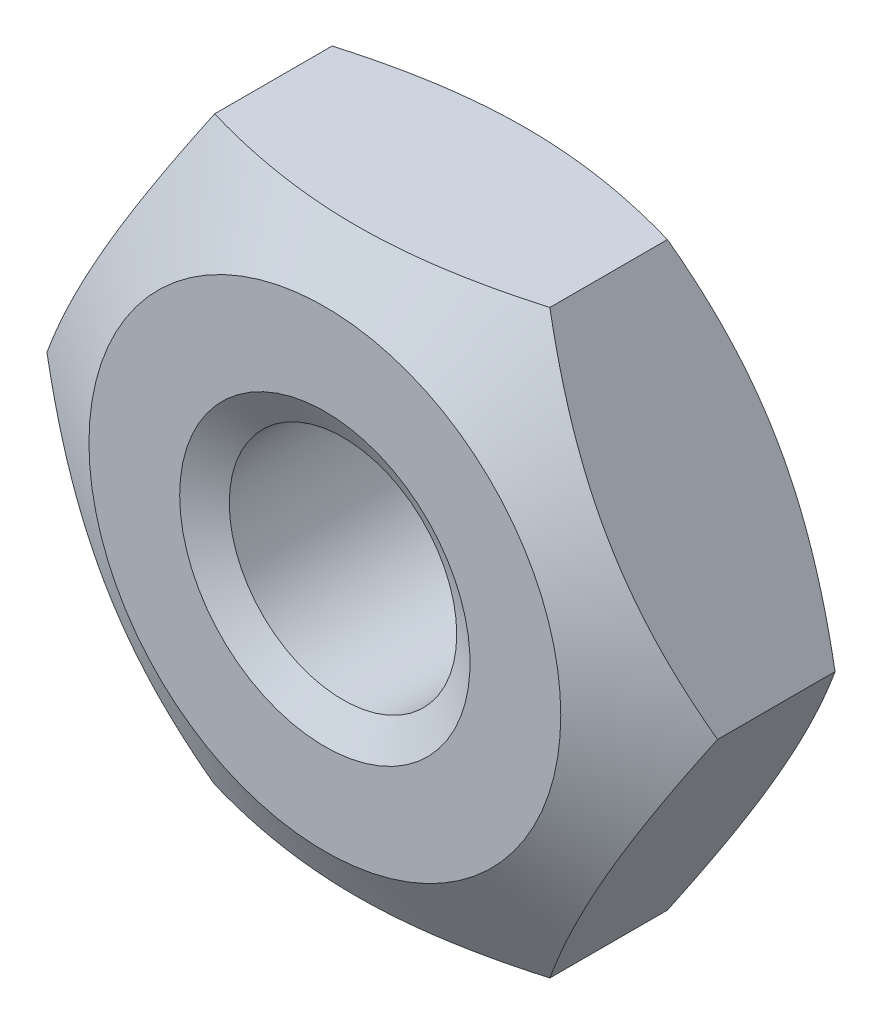
ISO-10303-21;
HEADER;
FILE_DESCRIPTION(('STEP AP214'),'2;1');
FILE_NAME('part.step','',(''),(''),'','','');
FILE_SCHEMA(('AUTOMOTIVE_DESIGN { 1 0 10303 214 1 1 1 1 }'));
ENDSEC;
DATA;
#1=APPLICATION_CONTEXT('core data for automotive mechanical design processes');
#2=APPLICATION_PROTOCOL_DEFINITION('international standard','automotive_design',2000,#1);
#3=PRODUCT_CONTEXT('',#1,'mechanical');
#4=PRODUCT('Part','Part','',(#3));
#5=PRODUCT_RELATED_PRODUCT_CATEGORY('part','',(#4));
#6=PRODUCT_DEFINITION_FORMATION('','',#4);
#7=PRODUCT_DEFINITION_CONTEXT('part definition',#1,'design');
#8=PRODUCT_DEFINITION('design','',#6,#7);
#9=PRODUCT_DEFINITION_SHAPE('','',#8);
#10=(LENGTH_UNIT() NAMED_UNIT(*) SI_UNIT(.MILLI.,.METRE.));
#11=(NAMED_UNIT(*) PLANE_ANGLE_UNIT() SI_UNIT($,.RADIAN.));
#12=(NAMED_UNIT(*) SI_UNIT($,.STERADIAN.) SOLID_ANGLE_UNIT());
#13=UNCERTAINTY_MEASURE_WITH_UNIT(LENGTH_MEASURE(1.E-05),#10,'distance_accuracy_value','');
#14=(GEOMETRIC_REPRESENTATION_CONTEXT(3) GLOBAL_UNCERTAINTY_ASSIGNED_CONTEXT((#13)) GLOBAL_UNIT_ASSIGNED_CONTEXT((#10,
#11,#12)) REPRESENTATION_CONTEXT('',''));
#15=CARTESIAN_POINT('',(0.,0.,0.));
#16=DIRECTION('',(0.,0.,1.));
#17=DIRECTION('',(1.,0.,0.));
#18=AXIS2_PLACEMENT_3D('',#15,#16,#17);
#19=CARTESIAN_POINT('',(1.15470053837925,-2.,-1.6));
#20=DIRECTION('',(0.866025403784439,-0.5,0.));
#21=DIRECTION('',(0.5,0.866025403784439,0.));
#22=AXIS2_PLACEMENT_3D('',#19,#20,#21);
#23=PLANE('',#22);
#24=CARTESIAN_POINT('',(1.15458506832542,-2.0002,-0.395205817566604));
#25=CARTESIAN_POINT('',(1.20532911262018,-1.91230873709994,-0.365895887046785));
#26=CARTESIAN_POINT('',(1.2565111744778,-1.82365880552641,-0.339239202926574));
#27=CARTESIAN_POINT('',(1.3597616401932,-1.6448237530022,-0.292708841966829));
#28=CARTESIAN_POINT('',(1.41183187919145,-1.55463545349496,-0.272851627328887));
#29=CARTESIAN_POINT('',(1.51532701829183,-1.37537661423669,-0.241939814969361));
#30=CARTESIAN_POINT('',(1.56673599086579,-1.2863336617737,-0.230679502544639));
#31=CARTESIAN_POINT('',(1.66979593505373,-1.10782860221496,-0.21723501354075));
#32=CARTESIAN_POINT('',(1.72144653186532,-1.01836714429604,-0.215039705899577));
#33=CARTESIAN_POINT('',(1.81796535054794,-0.851191646451202,-0.219597340276757));
#34=CARTESIAN_POINT('',(1.86284799277603,-0.773452629734217,-0.225231225633123));
#35=CARTESIAN_POINT('',(1.95232085557725,-0.618481085463868,-0.243090246206937));
#36=CARTESIAN_POINT('',(1.99691076648954,-0.541249094258803,-0.255321486969548));
#37=CARTESIAN_POINT('',(2.08656822922816,-0.3859578135178,-0.285899787813718));
#38=CARTESIAN_POINT('',(2.13162442866767,-0.307918186892622,-0.304376518011823));
#39=CARTESIAN_POINT('',(2.221064675979,-0.153003134307867,-0.346311869158963));
#40=CARTESIAN_POINT('',(2.26544987045196,-0.0761257223768818,-0.36976063143842));
#41=CARTESIAN_POINT('',(2.30951654681234,0.000199999999998162,-0.395205817566604));
#42=B_SPLINE_CURVE_WITH_KNOTS('',3,(#24,#25,#26,#27,#28,#29,#30,#31,#32,#33,#34,#35,#36,#37,#38,
#39,#40,#41),.UNSPECIFIED.,.F.,.F.,(4,2,2,2,2,2,2,2,4),(0.,0.317031824695609,0.634825876346563,
0.944753967652635,1.25430138000371,1.52387047293094,1.79368946861028,2.06949491027634,
2.34475850821472),.UNSPECIFIED.);
#43=CARTESIAN_POINT('',(1.15470053837925,-2.,-0.395139145900186));
#44=VERTEX_POINT('',#43);
#45=CARTESIAN_POINT('',(2.3094010767585,0.,-0.395139145900186));
#46=VERTEX_POINT('',#45);
#47=EDGE_CURVE('E49',#44,#46,#42,.T.);
#48=ORIENTED_EDGE('',*,*,#47,.F.);
#49=DIRECTION('',(0.,0.,1.));
#50=VECTOR('',#49,1.);
#51=CARTESIAN_POINT('',(1.15470053837925,-2.,-1.6));
#52=LINE('',#51,#50);
#53=CARTESIAN_POINT('',(1.15470053837925,-2.,-1.20486085409981));
#54=VERTEX_POINT('',#53);
#55=EDGE_CURVE('E113',#54,#44,#52,.T.);
#56=ORIENTED_EDGE('',*,*,#55,.F.);
#57=CARTESIAN_POINT('',(2.30951654681234,0.000199999999998123,-1.2047941824334));
#58=CARTESIAN_POINT('',(2.25877250251758,-0.0876912629000618,-1.23410411295321));
#59=CARTESIAN_POINT('',(2.20759044065996,-0.176341194473593,-1.26076079707343));
#60=CARTESIAN_POINT('',(2.10433997494456,-0.355176246997804,-1.30729115803317));
#61=CARTESIAN_POINT('',(2.05226973594631,-0.445364546505038,-1.32714837267111));
#62=CARTESIAN_POINT('',(1.94877459684592,-0.624623385763308,-1.35806018503064));
#63=CARTESIAN_POINT('',(1.89736562427197,-0.713666338226306,-1.36932049745536));
#64=CARTESIAN_POINT('',(1.79430568008403,-0.892171397785045,-1.38276498645925));
#65=CARTESIAN_POINT('',(1.74265508327244,-0.98163285570396,-1.38496029410042));
#66=CARTESIAN_POINT('',(1.64613626458982,-1.1488083535488,-1.38040265972324));
#67=CARTESIAN_POINT('',(1.60125362236173,-1.22654737026578,-1.37476877436688));
#68=CARTESIAN_POINT('',(1.51178075956051,-1.38151891453613,-1.35690975379306));
#69=CARTESIAN_POINT('',(1.46719084864821,-1.4587509057412,-1.34467851303045));
#70=CARTESIAN_POINT('',(1.37753338590959,-1.6140421864822,-1.31410021218628));
#71=CARTESIAN_POINT('',(1.33247718647009,-1.69208181310738,-1.29562348198818));
#72=CARTESIAN_POINT('',(1.24303693915876,-1.84699686569213,-1.25368813084104));
#73=CARTESIAN_POINT('',(1.1986517446858,-1.92387427762312,-1.23023936856158));
#74=CARTESIAN_POINT('',(1.15458506832542,-2.0002,-1.2047941824334));
#75=B_SPLINE_CURVE_WITH_KNOTS('',3,(#57,#58,#59,#60,#61,#62,#63,#64,#65,#66,#67,#68,#69,#70,#71,
#72,#73,#74),.UNSPECIFIED.,.F.,.F.,(4,2,2,2,2,2,2,2,4),(0.,0.317031824695609,0.634825876346563,
0.944753967652635,1.25430138000371,1.52387047293094,1.79368946861028,2.06949491027633,
2.34475850821472),.UNSPECIFIED.);
#76=CARTESIAN_POINT('',(2.3094010767585,0.,-1.20486085409981));
#77=VERTEX_POINT('',#76);
#78=EDGE_CURVE('E124',#77,#54,#75,.T.);
#79=ORIENTED_EDGE('',*,*,#78,.F.);
#80=DIRECTION('',(0.,0.,1.));
#81=VECTOR('',#80,1.);
#82=CARTESIAN_POINT('',(2.3094010767585,0.,-1.6));
#83=LINE('',#82,#81);
#84=EDGE_CURVE('E121',#77,#46,#83,.T.);
#85=ORIENTED_EDGE('',*,*,#84,.T.);
#86=EDGE_LOOP('',(#48,#56,#79,#85));
#87=FACE_BOUND('',#86,.T.);
#88=ADVANCED_FACE('F34',(#87),#23,.T.);
#89=CARTESIAN_POINT('',(-1.15470053837925,-2.,-1.6));
#90=DIRECTION('',(0.,-1.,0.));
#91=DIRECTION('',(0.,0.,-1.));
#92=AXIS2_PLACEMENT_3D('',#89,#90,#91);
#93=PLANE('',#92);
#94=CARTESIAN_POINT('',(-3.03250840446918,-2.,-1.15911418467749));
#95=CARTESIAN_POINT('',(-2.94570216761566,-2.,-1.11728838375975));
#96=CARTESIAN_POINT('',(-2.85868903658518,-2.,-1.07588421357432));
#97=CARTESIAN_POINT('',(-2.68413865700594,-2.,-0.994157816570392));
#98=CARTESIAN_POINT('',(-2.59660132161435,-2.,-0.953835775449659));
#99=CARTESIAN_POINT('',(-2.42040708466766,-2.,-0.874294412119375));
#100=CARTESIAN_POINT('',(-2.33174662853969,-2.,-0.835082935009986));
#101=CARTESIAN_POINT('',(-2.15369573865635,-2.,-0.758360253248594));
#102=CARTESIAN_POINT('',(-2.06430534187055,-2.,-0.720848963109221));
#103=CARTESIAN_POINT('',(-1.8820653553478,-2.,-0.646928613773647));
#104=CARTESIAN_POINT('',(-1.78919019398347,-2.,-0.610582236381783));
#105=CARTESIAN_POINT('',(-1.60232809770304,-2.,-0.540811653175612));
#106=CARTESIAN_POINT('',(-1.50834103590926,-2.,-0.507387784568963));
#107=CARTESIAN_POINT('',(-1.31930912607903,-2.,-0.444391999492289));
#108=CARTESIAN_POINT('',(-1.22426717272704,-2.,-0.41481148838992));
#109=CARTESIAN_POINT('',(-1.03281454203492,-2.,-0.360492543755219));
#110=CARTESIAN_POINT('',(-0.936404206520195,-2.,-0.335752923018285));
#111=CARTESIAN_POINT('',(-0.742683895879965,-2.,-0.292476872381369));
#112=CARTESIAN_POINT('',(-0.645380883042344,-2.,-0.273909873270285));
#113=CARTESIAN_POINT('',(-0.449641904459803,-2.,-0.244075358121521));
#114=CARTESIAN_POINT('',(-0.35120602504513,-2.,-0.232807289567762));
#115=CARTESIAN_POINT('',(-0.154944401250975,-2.,-0.218620651886438));
#116=CARTESIAN_POINT('',(-0.0571262337389415,-2.,-0.215600250518867));
#117=CARTESIAN_POINT('',(0.13840821715158,-2.,-0.217889203962766));
#118=CARTESIAN_POINT('',(0.23612449621104,-2.,-0.223198898582084));
#119=CARTESIAN_POINT('',(0.474834598693539,-2.,-0.24587699687209));
#120=CARTESIAN_POINT('',(0.615414939156776,-2.,-0.267612933114207));
#121=CARTESIAN_POINT('',(0.89388367740665,-2.,-0.324330248405078));
#122=CARTESIAN_POINT('',(1.03176910046046,-2.,-0.359325481167571));
#123=CARTESIAN_POINT('',(1.30766088186311,-2.,-0.439663106453157));
#124=CARTESIAN_POINT('',(1.44560515870347,-2.,-0.485213217220671));
#125=CARTESIAN_POINT('',(1.71895054267006,-2.,-0.583134546221804));
#126=CARTESIAN_POINT('',(1.85435246826094,-2.,-0.635503524618285));
#127=CARTESIAN_POINT('',(2.16299895593881,-2.,-0.761144092148935));
#128=CARTESIAN_POINT('',(2.33558576685763,-2.,-0.836015496754361));
#129=CARTESIAN_POINT('',(2.67849921319012,-2.,-0.990795114978597));
#130=CARTESIAN_POINT('',(2.84882534036042,-2.,-1.07070443875056));
#131=CARTESIAN_POINT('',(3.18800420393673,-2.,-1.23394816410341));
#132=CARTESIAN_POINT('',(3.35685551895014,-2.,-1.31728550472846));
#133=CARTESIAN_POINT('',(3.69339259485044,-2.,-1.48628333053348));
#134=CARTESIAN_POINT('',(3.86107832131448,-2.,-1.57194388396081));
#135=CARTESIAN_POINT('',(4.18245053956064,-2.,-1.7381347485726));
#136=CARTESIAN_POINT('',(4.33620209616309,-2.,-1.81853954842691));
#137=CARTESIAN_POINT('',(4.64314586019053,-2.,-1.98041904763657));
#138=CARTESIAN_POINT('',(4.7963380513568,-2.,-2.06189377777947));
#139=CARTESIAN_POINT('',(5.10195525058454,-2.,-2.22548861742329));
#140=CARTESIAN_POINT('',(5.25438119884233,-2.,-2.30760697283834));
#141=CARTESIAN_POINT('',(5.55887293685447,-2.,-2.47249183890614));
#142=CARTESIAN_POINT('',(5.71093874332869,-2.,-2.55525831866922));
#143=CARTESIAN_POINT('',(5.86287059695486,-2.,-2.63826829368966));
#144=B_SPLINE_CURVE_WITH_KNOTS('',3,(#94,#95,#96,#97,#98,#99,#100,#101,#102,#103,#104,#105,#106,
#107,#108,#109,#110,#111,#112,#113,#114,#115,#116,#117,#118,#119,#120,#121,#122,#123,#124,#125,
#126,#127,#128,#129,#130,#131,#132,#133,#134,#135,#136,#137,#138,#139,#140,#141,#142,#143),
.UNSPECIFIED.,.F.,.F.,(4,2,2,2,2,2,2,2,2,2,2,2,2,2,2,2,2,2,2,2,2,2,2,2,4),(0.,0.289075652567154,
0.578200598544058,0.869019545903255,1.15982385429035,1.45898764785607,1.7581859143945,
2.0567031465791,2.35514707686766,2.65209018023668,2.94901080291253,3.2422484683487,
3.53549809607817,3.96136880001581,4.38768569908869,4.82323744157937,5.25864647482538,
5.82289331524574,6.38726493035206,6.95213093439244,7.51701355011007,8.03752752207474,
8.55805650494496,9.07747163309884,9.59686215474679),.UNSPECIFIED.);
#145=CARTESIAN_POINT('',(-1.15470053837925,-2.,-0.395139145900186));
#146=VERTEX_POINT('',#145);
#147=EDGE_CURVE('E106',#146,#44,#144,.T.);
#148=ORIENTED_EDGE('',*,*,#147,.F.);
#149=DIRECTION('',(0.,0.,1.));
#150=VECTOR('',#149,1.);
#151=CARTESIAN_POINT('',(-1.15470053837925,-2.,-1.6));
#152=LINE('',#151,#150);
#153=CARTESIAN_POINT('',(-1.15470053837925,-2.,-1.20486085409981));
#154=VERTEX_POINT('',#153);
#155=EDGE_CURVE('E105',#154,#146,#152,.T.);
#156=ORIENTED_EDGE('',*,*,#155,.F.);
#157=CARTESIAN_POINT('',(-3.03250840446918,-2.,-0.440885815322511));
#158=CARTESIAN_POINT('',(-2.94570216761566,-2.,-0.482711616240248));
#159=CARTESIAN_POINT('',(-2.85868903658518,-2.,-0.52411578642568));
#160=CARTESIAN_POINT('',(-2.68413865700594,-2.,-0.605842183429609));
#161=CARTESIAN_POINT('',(-2.59660132161435,-2.,-0.646164224550342));
#162=CARTESIAN_POINT('',(-2.42040708466766,-2.,-0.725705587880626));
#163=CARTESIAN_POINT('',(-2.33174662853969,-2.,-0.764917064990015));
#164=CARTESIAN_POINT('',(-2.15369573865635,-2.,-0.841639746751407));
#165=CARTESIAN_POINT('',(-2.06430534187055,-2.,-0.87915103689078));
#166=CARTESIAN_POINT('',(-1.8820653553478,-2.,-0.953071386226354));
#167=CARTESIAN_POINT('',(-1.78919019398347,-2.,-0.989417763618218));
#168=CARTESIAN_POINT('',(-1.60232809770304,-2.,-1.05918834682439));
#169=CARTESIAN_POINT('',(-1.50834103590926,-2.,-1.09261221543104));
#170=CARTESIAN_POINT('',(-1.31930912607903,-2.,-1.15560800050771));
#171=CARTESIAN_POINT('',(-1.22426717272704,-2.,-1.18518851161008));
#172=CARTESIAN_POINT('',(-1.03281454203492,-2.,-1.23950745624478));
#173=CARTESIAN_POINT('',(-0.936404206520195,-2.,-1.26424707698172));
#174=CARTESIAN_POINT('',(-0.742683895879966,-2.,-1.30752312761863));
#175=CARTESIAN_POINT('',(-0.645380883042344,-2.,-1.32609012672972));
#176=CARTESIAN_POINT('',(-0.449641904459803,-2.,-1.35592464187848));
#177=CARTESIAN_POINT('',(-0.35120602504513,-2.,-1.36719271043224));
#178=CARTESIAN_POINT('',(-0.154944401250975,-2.,-1.38137934811356));
#179=CARTESIAN_POINT('',(-0.0571262337389412,-2.,-1.38439974948113));
#180=CARTESIAN_POINT('',(0.138408217151581,-2.,-1.38211079603723));
#181=CARTESIAN_POINT('',(0.23612449621104,-2.,-1.37680110141792));
#182=CARTESIAN_POINT('',(0.474834598693539,-2.,-1.35412300312791));
#183=CARTESIAN_POINT('',(0.615414939156776,-2.,-1.33238706688579));
#184=CARTESIAN_POINT('',(0.89388367740665,-2.,-1.27566975159492));
#185=CARTESIAN_POINT('',(1.03176910046046,-2.,-1.24067451883243));
#186=CARTESIAN_POINT('',(1.30766088186311,-2.,-1.16033689354684));
#187=CARTESIAN_POINT('',(1.44560515870347,-2.,-1.11478678277933));
#188=CARTESIAN_POINT('',(1.71895054267007,-2.,-1.0168654537782));
#189=CARTESIAN_POINT('',(1.85435246826095,-2.,-0.964496475381715));
#190=CARTESIAN_POINT('',(2.16299895593881,-2.,-0.838855907851066));
#191=CARTESIAN_POINT('',(2.33558576685764,-2.,-0.76398450324564));
#192=CARTESIAN_POINT('',(2.67849921319012,-2.,-0.609204885021404));
#193=CARTESIAN_POINT('',(2.84882534036042,-2.,-0.529295561249443));
#194=CARTESIAN_POINT('',(3.18800420393673,-2.,-0.366051835896594));
#195=CARTESIAN_POINT('',(3.35685551895014,-2.,-0.282714495271539));
#196=CARTESIAN_POINT('',(3.69339259485044,-2.,-0.113716669466521));
#197=CARTESIAN_POINT('',(3.86107832131448,-2.,-0.0280561160391938));
#198=CARTESIAN_POINT('',(4.18245053956064,-2.,0.138134748572596));
#199=CARTESIAN_POINT('',(4.33620209616309,-2.,0.218539548426913));
#200=CARTESIAN_POINT('',(4.64314586019053,-2.,0.380419047636573));
#201=CARTESIAN_POINT('',(4.7963380513568,-2.,0.461893777779472));
#202=CARTESIAN_POINT('',(5.10195525058454,-2.,0.625488617423287));
#203=CARTESIAN_POINT('',(5.25438119884234,-2.,0.707606972838339));
#204=CARTESIAN_POINT('',(5.55887293685447,-2.,0.872491838906139));
#205=CARTESIAN_POINT('',(5.71093874332869,-2.,0.955258318669218));
#206=CARTESIAN_POINT('',(5.86287059695486,-2.,1.03826829368966));
#207=B_SPLINE_CURVE_WITH_KNOTS('',3,(#157,#158,#159,#160,#161,#162,#163,#164,#165,#166,#167,
#168,#169,#170,#171,#172,#173,#174,#175,#176,#177,#178,#179,#180,#181,#182,#183,#184,#185,#186,
#187,#188,#189,#190,#191,#192,#193,#194,#195,#196,#197,#198,#199,#200,#201,#202,#203,#204,#205,
#206),.UNSPECIFIED.,.F.,.F.,(4,2,2,2,2,2,2,2,2,2,2,2,2,2,2,2,2,2,2,2,2,2,2,2,4),(0.,
0.289075652567155,0.578200598544059,0.869019545903256,1.15982385429036,1.45898764785607,
1.75818591439451,2.0567031465791,2.35514707686765,2.65209018023668,2.94901080291253,
3.2422484683487,3.53549809607817,3.96136880001581,4.38768569908869,4.82323744157938,
5.25864647482539,5.82289331524574,6.38726493035206,6.95213093439244,7.51701355011007,
8.03752752207474,8.55805650494497,9.07747163309885,9.59686215474679),.UNSPECIFIED.);
#208=EDGE_CURVE('E200',#54,#154,#207,.F.);
#209=ORIENTED_EDGE('',*,*,#208,.F.);
#210=ORIENTED_EDGE('',*,*,#55,.T.);
#211=EDGE_LOOP('',(#148,#156,#209,#210));
#212=FACE_BOUND('',#211,.T.);
#213=ADVANCED_FACE('F210',(#212),#93,.T.);
#214=CARTESIAN_POINT('',(-2.3094010767585,0.,-1.6));
#215=DIRECTION('',(-0.866025403784438,-0.5,0.));
#216=DIRECTION('',(0.5,-0.866025403784438,0.));
#217=AXIS2_PLACEMENT_3D('',#214,#215,#216);
#218=PLANE('',#217);
#219=CARTESIAN_POINT('',(-2.30951654681234,0.000200000000000497,-0.395205817566603));
#220=CARTESIAN_POINT('',(-2.25877250251757,-0.0876912629000592,-0.365895887046784));
#221=CARTESIAN_POINT('',(-2.20759044065995,-0.176341194473591,-0.339239202926572));
#222=CARTESIAN_POINT('',(-2.10433997494456,-0.355176246997801,-0.292708841966827));
#223=CARTESIAN_POINT('',(-2.0522697359463,-0.445364546505035,-0.272851627328885));
#224=CARTESIAN_POINT('',(-1.94877459684592,-0.624623385763304,-0.241939814969359));
#225=CARTESIAN_POINT('',(-1.89736562427197,-0.713666338226302,-0.230679502544638));
#226=CARTESIAN_POINT('',(-1.79430568008402,-0.892171397785041,-0.217235013540748));
#227=CARTESIAN_POINT('',(-1.74265508327244,-0.981632855703956,-0.215039705899575));
#228=CARTESIAN_POINT('',(-1.64613626458981,-1.1488083535488,-0.219597340276755));
#229=CARTESIAN_POINT('',(-1.60125362236172,-1.22654737026578,-0.225231225633121));
#230=CARTESIAN_POINT('',(-1.51178075956051,-1.38151891453613,-0.243090246206934));
#231=CARTESIAN_POINT('',(-1.46719084864821,-1.4587509057412,-0.255321486969545));
#232=CARTESIAN_POINT('',(-1.37753338590959,-1.6140421864822,-0.285899787813715));
#233=CARTESIAN_POINT('',(-1.33247718647009,-1.69208181310738,-0.304376518011821));
#234=CARTESIAN_POINT('',(-1.24303693915875,-1.84699686569213,-0.346311869158961));
#235=CARTESIAN_POINT('',(-1.1986517446858,-1.92387427762312,-0.369760631438418));
#236=CARTESIAN_POINT('',(-1.15458506832541,-2.0002,-0.395205817566602));
#237=B_SPLINE_CURVE_WITH_KNOTS('',3,(#219,#220,#221,#222,#223,#224,#225,#226,#227,#228,#229,
#230,#231,#232,#233,#234,#235,#236),.UNSPECIFIED.,.F.,.F.,(4,2,2,2,2,2,2,2,4),(0.,
0.317031824695609,0.634825876346562,0.944753967652634,1.25430138000371,1.52387047293094,
1.79368946861028,2.06949491027634,2.34475850821472),.UNSPECIFIED.);
#238=CARTESIAN_POINT('',(-2.3094010767585,0.,-0.395139145900186));
#239=VERTEX_POINT('',#238);
#240=EDGE_CURVE('E89',#239,#146,#237,.T.);
#241=ORIENTED_EDGE('',*,*,#240,.F.);
#242=DIRECTION('',(0.,0.,1.));
#243=VECTOR('',#242,1.);
#244=CARTESIAN_POINT('',(-2.3094010767585,0.,-1.6));
#245=LINE('',#244,#243);
#246=CARTESIAN_POINT('',(-2.3094010767585,0.,-1.20486085409981));
#247=VERTEX_POINT('',#246);
#248=EDGE_CURVE('E103',#247,#239,#245,.T.);
#249=ORIENTED_EDGE('',*,*,#248,.F.);
#250=CARTESIAN_POINT('',(-1.15458506832541,-2.0002,-1.2047941824334));
#251=CARTESIAN_POINT('',(-1.20532911262018,-1.91230873709994,-1.23410411295322));
#252=CARTESIAN_POINT('',(-1.2565111744778,-1.82365880552641,-1.26076079707343));
#253=CARTESIAN_POINT('',(-1.35976164019319,-1.6448237530022,-1.30729115803317));
#254=CARTESIAN_POINT('',(-1.41183187919145,-1.55463545349496,-1.32714837267112));
#255=CARTESIAN_POINT('',(-1.51532701829183,-1.37537661423669,-1.35806018503064));
#256=CARTESIAN_POINT('',(-1.56673599086578,-1.2863336617737,-1.36932049745536));
#257=CARTESIAN_POINT('',(-1.66979593505373,-1.10782860221496,-1.38276498645925));
#258=CARTESIAN_POINT('',(-1.72144653186531,-1.01836714429604,-1.38496029410043));
#259=CARTESIAN_POINT('',(-1.81796535054794,-0.851191646451204,-1.38040265972325));
#260=CARTESIAN_POINT('',(-1.86284799277603,-0.773452629734218,-1.37476877436688));
#261=CARTESIAN_POINT('',(-1.95232085557725,-0.618481085463868,-1.35690975379307));
#262=CARTESIAN_POINT('',(-1.99691076648954,-0.541249094258802,-1.34467851303046));
#263=CARTESIAN_POINT('',(-2.08656822922816,-0.3859578135178,-1.31410021218629));
#264=CARTESIAN_POINT('',(-2.13162442866767,-0.307918186892621,-1.29562348198818));
#265=CARTESIAN_POINT('',(-2.221064675979,-0.153003134307865,-1.25368813084104));
#266=CARTESIAN_POINT('',(-2.26544987045196,-0.0761257223768796,-1.23023936856158));
#267=CARTESIAN_POINT('',(-2.30951654681234,0.000200000000000712,-1.2047941824334));
#268=B_SPLINE_CURVE_WITH_KNOTS('',3,(#250,#251,#252,#253,#254,#255,#256,#257,#258,#259,#260,
#261,#262,#263,#264,#265,#266,#267),.UNSPECIFIED.,.F.,.F.,(4,2,2,2,2,2,2,2,4),(0.,
0.317031824695609,0.634825876346562,0.944753967652634,1.25430138000371,1.52387047293094,
1.79368946861028,2.06949491027634,2.34475850821472),.UNSPECIFIED.);
#269=EDGE_CURVE('E193',#154,#247,#268,.T.);
#270=ORIENTED_EDGE('',*,*,#269,.F.);
#271=ORIENTED_EDGE('',*,*,#155,.T.);
#272=EDGE_LOOP('',(#241,#249,#270,#271));
#273=FACE_BOUND('',#272,.T.);
#274=ADVANCED_FACE('F101',(#273),#218,.T.);
#275=CARTESIAN_POINT('',(-1.15470053837925,2.,-1.6));
#276=DIRECTION('',(-0.866025403784439,0.5,0.));
#277=DIRECTION('',(-0.5,-0.866025403784439,0.));
#278=AXIS2_PLACEMENT_3D('',#275,#276,#277);
#279=PLANE('',#278);
#280=CARTESIAN_POINT('',(-1.15458506832541,2.0002,-0.395205817566603));
#281=CARTESIAN_POINT('',(-1.20532911262018,1.91230873709994,-0.365895887046784));
#282=CARTESIAN_POINT('',(-1.2565111744778,1.82365880552641,-0.339239202926573));
#283=CARTESIAN_POINT('',(-1.35976164019319,1.6448237530022,-0.292708841966827));
#284=CARTESIAN_POINT('',(-1.41183187919145,1.55463545349496,-0.272851627328886));
#285=CARTESIAN_POINT('',(-1.51532701829183,1.3753766142367,-0.241939814969359));
#286=CARTESIAN_POINT('',(-1.56673599086578,1.2863336617737,-0.230679502544638));
#287=CARTESIAN_POINT('',(-1.66979593505373,1.10782860221496,-0.217235013540749));
#288=CARTESIAN_POINT('',(-1.72144653186531,1.01836714429604,-0.215039705899575));
#289=CARTESIAN_POINT('',(-1.81796535054794,0.851191646451204,-0.219597340276755));
#290=CARTESIAN_POINT('',(-1.86284799277603,0.773452629734218,-0.225231225633121));
#291=CARTESIAN_POINT('',(-1.95232085557725,0.618481085463868,-0.243090246206935));
#292=CARTESIAN_POINT('',(-1.99691076648954,0.541249094258803,-0.255321486969546));
#293=CARTESIAN_POINT('',(-2.08656822922816,0.3859578135178,-0.285899787813716));
#294=CARTESIAN_POINT('',(-2.13162442866767,0.307918186892622,-0.304376518011822));
#295=CARTESIAN_POINT('',(-2.221064675979,0.153003134307866,-0.346311869158961));
#296=CARTESIAN_POINT('',(-2.26544987045196,0.0761257223768806,-0.369760631438419));
#297=CARTESIAN_POINT('',(-2.30951654681234,-0.000199999999999771,-0.395205817566603));
#298=B_SPLINE_CURVE_WITH_KNOTS('',3,(#280,#281,#282,#283,#284,#285,#286,#287,#288,#289,#290,
#291,#292,#293,#294,#295,#296,#297),.UNSPECIFIED.,.F.,.F.,(4,2,2,2,2,2,2,2,4),(0.,
0.317031824695609,0.634825876346562,0.944753967652634,1.25430138000371,1.52387047293094,
1.79368946861028,2.06949491027634,2.34475850821472),.UNSPECIFIED.);
#299=CARTESIAN_POINT('',(-1.15470053837925,2.,-0.395139145900186));
#300=VERTEX_POINT('',#299);
#301=EDGE_CURVE('E85',#300,#239,#298,.T.);
#302=ORIENTED_EDGE('',*,*,#301,.F.);
#303=DIRECTION('',(0.,0.,1.));
#304=VECTOR('',#303,1.);
#305=CARTESIAN_POINT('',(-1.15470053837925,2.,-1.6));
#306=LINE('',#305,#304);
#307=CARTESIAN_POINT('',(-1.15470053837925,2.,-1.20486085409981));
#308=VERTEX_POINT('',#307);
#309=EDGE_CURVE('E111',#308,#300,#306,.T.);
#310=ORIENTED_EDGE('',*,*,#309,.F.);
#311=CARTESIAN_POINT('',(-2.30951654681234,-0.000199999999999541,-1.2047941824334));
#312=CARTESIAN_POINT('',(-2.25877250251757,0.0876912629000601,-1.23410411295322));
#313=CARTESIAN_POINT('',(-2.20759044065995,0.176341194473592,-1.26076079707343));
#314=CARTESIAN_POINT('',(-2.10433997494456,0.355176246997802,-1.30729115803317));
#315=CARTESIAN_POINT('',(-2.0522697359463,0.445364546505036,-1.32714837267112));
#316=CARTESIAN_POINT('',(-1.94877459684592,0.624623385763305,-1.35806018503064));
#317=CARTESIAN_POINT('',(-1.89736562427197,0.713666338226303,-1.36932049745536));
#318=CARTESIAN_POINT('',(-1.79430568008402,0.892171397785042,-1.38276498645925));
#319=CARTESIAN_POINT('',(-1.74265508327244,0.981632855703957,-1.38496029410043));
#320=CARTESIAN_POINT('',(-1.64613626458981,1.1488083535488,-1.38040265972325));
#321=CARTESIAN_POINT('',(-1.60125362236173,1.22654737026578,-1.37476877436688));
#322=CARTESIAN_POINT('',(-1.51178075956051,1.38151891453613,-1.35690975379307));
#323=CARTESIAN_POINT('',(-1.46719084864821,1.4587509057412,-1.34467851303045));
#324=CARTESIAN_POINT('',(-1.37753338590959,1.6140421864822,-1.31410021218628));
#325=CARTESIAN_POINT('',(-1.33247718647009,1.69208181310738,-1.29562348198818));
#326=CARTESIAN_POINT('',(-1.24303693915875,1.84699686569213,-1.25368813084104));
#327=CARTESIAN_POINT('',(-1.1986517446858,1.92387427762312,-1.23023936856158));
#328=CARTESIAN_POINT('',(-1.15458506832541,2.0002,-1.2047941824334));
#329=B_SPLINE_CURVE_WITH_KNOTS('',3,(#311,#312,#313,#314,#315,#316,#317,#318,#319,#320,#321,
#322,#323,#324,#325,#326,#327,#328),.UNSPECIFIED.,.F.,.F.,(4,2,2,2,2,2,2,2,4),(0.,
0.317031824695609,0.634825876346562,0.944753967652634,1.25430138000371,1.52387047293094,
1.79368946861028,2.06949491027634,2.34475850821472),.UNSPECIFIED.);
#330=EDGE_CURVE('E110',#247,#308,#329,.T.);
#331=ORIENTED_EDGE('',*,*,#330,.F.);
#332=ORIENTED_EDGE('',*,*,#248,.T.);
#333=EDGE_LOOP('',(#302,#310,#331,#332));
#334=FACE_BOUND('',#333,.T.);
#335=ADVANCED_FACE('F109',(#334),#279,.T.);
#336=CARTESIAN_POINT('',(1.15470053837925,2.,-1.6));
#337=DIRECTION('',(0.,1.,0.));
#338=DIRECTION('',(0.,0.,1.));
#339=AXIS2_PLACEMENT_3D('',#336,#337,#338);
#340=PLANE('',#339);
#341=CARTESIAN_POINT('',(-3.03250840446919,2.,-1.15911418467749));
#342=CARTESIAN_POINT('',(-2.94570216761566,2.,-1.11728838375975));
#343=CARTESIAN_POINT('',(-2.85868903658519,2.,-1.07588421357432));
#344=CARTESIAN_POINT('',(-2.68413865700595,2.,-0.994157816570393));
#345=CARTESIAN_POINT('',(-2.59660132161436,2.,-0.953835775449661));
#346=CARTESIAN_POINT('',(-2.42040708466766,2.,-0.874294412119377));
#347=CARTESIAN_POINT('',(-2.33174662853969,2.,-0.835082935009987));
#348=CARTESIAN_POINT('',(-2.15369573865635,2.,-0.758360253248595));
#349=CARTESIAN_POINT('',(-2.06430534187055,2.,-0.720848963109223));
#350=CARTESIAN_POINT('',(-1.8820653553478,2.,-0.646928613773648));
#351=CARTESIAN_POINT('',(-1.78919019398347,2.,-0.610582236381784));
#352=CARTESIAN_POINT('',(-1.60232809770304,2.,-0.540811653175613));
#353=CARTESIAN_POINT('',(-1.50834103590927,2.,-0.507387784568963));
#354=CARTESIAN_POINT('',(-1.31930912607904,2.,-0.44439199949229));
#355=CARTESIAN_POINT('',(-1.22426717272704,2.,-0.414811488389921));
#356=CARTESIAN_POINT('',(-1.03281454203492,2.,-0.360492543755219));
#357=CARTESIAN_POINT('',(-0.936404206520196,2.,-0.335752923018286));
#358=CARTESIAN_POINT('',(-0.742683895879967,2.,-0.29247687238137));
#359=CARTESIAN_POINT('',(-0.645380883042345,2.,-0.273909873270286));
#360=CARTESIAN_POINT('',(-0.449641904459804,2.,-0.244075358121522));
#361=CARTESIAN_POINT('',(-0.351206025045131,2.,-0.232807289567763));
#362=CARTESIAN_POINT('',(-0.154944401250975,2.,-0.218620651886438));
#363=CARTESIAN_POINT('',(-0.0571262337389418,2.,-0.215600250518868));
#364=CARTESIAN_POINT('',(0.13840821715158,2.,-0.217889203962766));
#365=CARTESIAN_POINT('',(0.23612449621104,2.,-0.223198898582085));
#366=CARTESIAN_POINT('',(0.474834598693539,2.,-0.24587699687209));
#367=CARTESIAN_POINT('',(0.615414939156775,2.,-0.267612933114207));
#368=CARTESIAN_POINT('',(0.893883677406649,2.,-0.324330248405079));
#369=CARTESIAN_POINT('',(1.03176910046046,2.,-0.359325481167571));
#370=CARTESIAN_POINT('',(1.30766088186311,2.,-0.439663106453157));
#371=CARTESIAN_POINT('',(1.44560515870347,2.,-0.485213217220671));
#372=CARTESIAN_POINT('',(1.71895054267006,2.,-0.583134546221804));
#373=CARTESIAN_POINT('',(1.85435246826095,2.,-0.635503524618285));
#374=CARTESIAN_POINT('',(2.16299895593881,2.,-0.761144092148935));
#375=CARTESIAN_POINT('',(2.33558576685763,2.,-0.836015496754361));
#376=CARTESIAN_POINT('',(2.67849921319012,2.,-0.990795114978597));
#377=CARTESIAN_POINT('',(2.84882534036041,2.,-1.07070443875056));
#378=CARTESIAN_POINT('',(3.18800420393673,2.,-1.23394816410341));
#379=CARTESIAN_POINT('',(3.35685551895014,2.,-1.31728550472846));
#380=CARTESIAN_POINT('',(3.69339259485043,2.,-1.48628333053348));
#381=CARTESIAN_POINT('',(3.86107832131448,2.,-1.57194388396081));
#382=CARTESIAN_POINT('',(4.18245053956064,2.,-1.7381347485726));
#383=CARTESIAN_POINT('',(4.33620209616309,2.,-1.81853954842691));
#384=CARTESIAN_POINT('',(4.64314586019053,2.,-1.98041904763657));
#385=CARTESIAN_POINT('',(4.79633805135679,2.,-2.06189377777947));
#386=CARTESIAN_POINT('',(5.10195525058454,2.,-2.22548861742329));
#387=CARTESIAN_POINT('',(5.25438119884233,2.,-2.30760697283834));
#388=CARTESIAN_POINT('',(5.55887293685447,2.,-2.47249183890614));
#389=CARTESIAN_POINT('',(5.71093874332869,2.,-2.55525831866922));
#390=CARTESIAN_POINT('',(5.86287059695486,2.,-2.63826829368965));
#391=B_SPLINE_CURVE_WITH_KNOTS('',3,(#341,#342,#343,#344,#345,#346,#347,#348,#349,#350,#351,
#352,#353,#354,#355,#356,#357,#358,#359,#360,#361,#362,#363,#364,#365,#366,#367,#368,#369,#370,
#371,#372,#373,#374,#375,#376,#377,#378,#379,#380,#381,#382,#383,#384,#385,#386,#387,#388,#389,
#390),.UNSPECIFIED.,.F.,.F.,(4,2,2,2,2,2,2,2,2,2,2,2,2,2,2,2,2,2,2,2,2,2,2,2,4),(0.,
0.289075652567155,0.578200598544059,0.869019545903255,1.15982385429036,1.45898764785607,
1.75818591439451,2.0567031465791,2.35514707686766,2.65209018023668,2.94901080291253,
3.2422484683487,3.53549809607818,3.96136880001581,4.38768569908869,4.82323744157938,
5.25864647482539,5.82289331524574,6.38726493035206,6.95213093439244,7.51701355011007,
8.03752752207474,8.55805650494496,9.07747163309884,9.59686215474679),.UNSPECIFIED.);
#392=CARTESIAN_POINT('',(1.15470053837925,2.,-0.395139145900186));
#393=VERTEX_POINT('',#392);
#394=EDGE_CURVE('E92',#393,#300,#391,.F.);
#395=ORIENTED_EDGE('',*,*,#394,.F.);
#396=DIRECTION('',(0.,0.,1.));
#397=VECTOR('',#396,1.);
#398=CARTESIAN_POINT('',(1.15470053837925,2.,-1.6));
#399=LINE('',#398,#397);
#400=CARTESIAN_POINT('',(1.15470053837925,2.,-1.20486085409981));
#401=VERTEX_POINT('',#400);
#402=EDGE_CURVE('E115',#401,#393,#399,.T.);
#403=ORIENTED_EDGE('',*,*,#402,.F.);
#404=CARTESIAN_POINT('',(-3.03250840446919,2.,-0.44088581532251));
#405=CARTESIAN_POINT('',(-2.94570216761566,2.,-0.482711616240246));
#406=CARTESIAN_POINT('',(-2.85868903658519,2.,-0.524115786425678));
#407=CARTESIAN_POINT('',(-2.68413865700595,2.,-0.605842183429608));
#408=CARTESIAN_POINT('',(-2.59660132161436,2.,-0.64616422455034));
#409=CARTESIAN_POINT('',(-2.42040708466766,2.,-0.725705587880624));
#410=CARTESIAN_POINT('',(-2.33174662853969,2.,-0.764917064990014));
#411=CARTESIAN_POINT('',(-2.15369573865635,2.,-0.841639746751406));
#412=CARTESIAN_POINT('',(-2.06430534187055,2.,-0.879151036890778));
#413=CARTESIAN_POINT('',(-1.8820653553478,2.,-0.953071386226353));
#414=CARTESIAN_POINT('',(-1.78919019398347,2.,-0.989417763618217));
#415=CARTESIAN_POINT('',(-1.60232809770304,2.,-1.05918834682439));
#416=CARTESIAN_POINT('',(-1.50834103590927,2.,-1.09261221543104));
#417=CARTESIAN_POINT('',(-1.31930912607904,2.,-1.15560800050771));
#418=CARTESIAN_POINT('',(-1.22426717272704,2.,-1.18518851161008));
#419=CARTESIAN_POINT('',(-1.03281454203492,2.,-1.23950745624478));
#420=CARTESIAN_POINT('',(-0.936404206520196,2.,-1.26424707698171));
#421=CARTESIAN_POINT('',(-0.742683895879967,2.,-1.30752312761863));
#422=CARTESIAN_POINT('',(-0.645380883042345,2.,-1.32609012672972));
#423=CARTESIAN_POINT('',(-0.449641904459804,2.,-1.35592464187848));
#424=CARTESIAN_POINT('',(-0.351206025045131,2.,-1.36719271043224));
#425=CARTESIAN_POINT('',(-0.154944401250975,2.,-1.38137934811356));
#426=CARTESIAN_POINT('',(-0.0571262337389418,2.,-1.38439974948113));
#427=CARTESIAN_POINT('',(0.13840821715158,2.,-1.38211079603723));
#428=CARTESIAN_POINT('',(0.236124496211039,2.,-1.37680110141792));
#429=CARTESIAN_POINT('',(0.474834598693539,2.,-1.35412300312791));
#430=CARTESIAN_POINT('',(0.615414939156775,2.,-1.33238706688579));
#431=CARTESIAN_POINT('',(0.893883677406649,2.,-1.27566975159492));
#432=CARTESIAN_POINT('',(1.03176910046045,2.,-1.24067451883243));
#433=CARTESIAN_POINT('',(1.30766088186311,2.,-1.16033689354684));
#434=CARTESIAN_POINT('',(1.44560515870347,2.,-1.11478678277933));
#435=CARTESIAN_POINT('',(1.71895054267006,2.,-1.0168654537782));
#436=CARTESIAN_POINT('',(1.85435246826094,2.,-0.964496475381715));
#437=CARTESIAN_POINT('',(2.16299895593881,2.,-0.838855907851066));
#438=CARTESIAN_POINT('',(2.33558576685763,2.,-0.76398450324564));
#439=CARTESIAN_POINT('',(2.67849921319012,2.,-0.609204885021405));
#440=CARTESIAN_POINT('',(2.84882534036041,2.,-0.529295561249444));
#441=CARTESIAN_POINT('',(3.18800420393672,2.,-0.366051835896595));
#442=CARTESIAN_POINT('',(3.35685551895014,2.,-0.28271449527154));
#443=CARTESIAN_POINT('',(3.69339259485043,2.,-0.113716669466523));
#444=CARTESIAN_POINT('',(3.86107832131447,2.,-0.0280561160391957));
#445=CARTESIAN_POINT('',(4.18245053956064,2.,0.138134748572594));
#446=CARTESIAN_POINT('',(4.33620209616309,2.,0.21853954842691));
#447=CARTESIAN_POINT('',(4.64314586019053,2.,0.38041904763657));
#448=CARTESIAN_POINT('',(4.79633805135679,2.,0.461893777779469));
#449=CARTESIAN_POINT('',(5.10195525058453,2.,0.625488617423284));
#450=CARTESIAN_POINT('',(5.25438119884233,2.,0.707606972838336));
#451=CARTESIAN_POINT('',(5.55887293685447,2.,0.872491838906135));
#452=CARTESIAN_POINT('',(5.71093874332869,2.,0.955258318669215));
#453=CARTESIAN_POINT('',(5.86287059695486,2.,1.03826829368965));
#454=B_SPLINE_CURVE_WITH_KNOTS('',3,(#404,#405,#406,#407,#408,#409,#410,#411,#412,#413,#414,
#415,#416,#417,#418,#419,#420,#421,#422,#423,#424,#425,#426,#427,#428,#429,#430,#431,#432,#433,
#434,#435,#436,#437,#438,#439,#440,#441,#442,#443,#444,#445,#446,#447,#448,#449,#450,#451,#452,
#453),.UNSPECIFIED.,.F.,.F.,(4,2,2,2,2,2,2,2,2,2,2,2,2,2,2,2,2,2,2,2,2,2,2,2,4),(0.,
0.289075652567155,0.578200598544059,0.869019545903256,1.15982385429036,1.45898764785607,
1.75818591439451,2.0567031465791,2.35514707686766,2.65209018023668,2.94901080291253,
3.2422484683487,3.53549809607818,3.96136880001581,4.38768569908869,4.82323744157938,
5.25864647482539,5.82289331524574,6.38726493035206,6.95213093439244,7.51701355011007,
8.03752752207473,8.55805650494496,9.07747163309884,9.59686215474678),.UNSPECIFIED.);
#455=EDGE_CURVE('E57',#308,#401,#454,.T.);
#456=ORIENTED_EDGE('',*,*,#455,.F.);
#457=ORIENTED_EDGE('',*,*,#309,.T.);
#458=EDGE_LOOP('',(#395,#403,#456,#457));
#459=FACE_BOUND('',#458,.T.);
#460=ADVANCED_FACE('F237',(#459),#340,.T.);
#461=CARTESIAN_POINT('',(2.3094010767585,0.,-1.6));
#462=DIRECTION('',(0.866025403784438,0.5,0.));
#463=DIRECTION('',(-0.5,0.866025403784439,0.));
#464=AXIS2_PLACEMENT_3D('',#461,#462,#463);
#465=PLANE('',#464);
#466=CARTESIAN_POINT('',(2.30951654681234,-0.000200000000001828,-0.395205817566604));
#467=CARTESIAN_POINT('',(2.25877250251758,0.0876912629000582,-0.365895887046786));
#468=CARTESIAN_POINT('',(2.20759044065996,0.176341194473589,-0.339239202926574));
#469=CARTESIAN_POINT('',(2.10433997494456,0.3551762469978,-0.292708841966828));
#470=CARTESIAN_POINT('',(2.05226973594631,0.445364546505034,-0.272851627328887));
#471=CARTESIAN_POINT('',(1.94877459684592,0.624623385763304,-0.24193981496936));
#472=CARTESIAN_POINT('',(1.89736562427197,0.713666338226302,-0.230679502544639));
#473=CARTESIAN_POINT('',(1.79430568008403,0.892171397785041,-0.217235013540749));
#474=CARTESIAN_POINT('',(1.74265508327244,0.981632855703956,-0.215039705899576));
#475=CARTESIAN_POINT('',(1.64613626458982,1.1488083535488,-0.219597340276756));
#476=CARTESIAN_POINT('',(1.60125362236173,1.22654737026578,-0.225231225633122));
#477=CARTESIAN_POINT('',(1.51178075956051,1.38151891453613,-0.243090246206935));
#478=CARTESIAN_POINT('',(1.46719084864821,1.4587509057412,-0.255321486969546));
#479=CARTESIAN_POINT('',(1.37753338590959,1.6140421864822,-0.285899787813716));
#480=CARTESIAN_POINT('',(1.33247718647009,1.69208181310738,-0.304376518011822));
#481=CARTESIAN_POINT('',(1.24303693915875,1.84699686569213,-0.346311869158962));
#482=CARTESIAN_POINT('',(1.1986517446858,1.92387427762312,-0.369760631438419));
#483=CARTESIAN_POINT('',(1.15458506832541,2.0002,-0.395205817566603));
#484=B_SPLINE_CURVE_WITH_KNOTS('',3,(#466,#467,#468,#469,#470,#471,#472,#473,#474,#475,#476,
#477,#478,#479,#480,#481,#482,#483),.UNSPECIFIED.,.F.,.F.,(4,2,2,2,2,2,2,2,4),(0.,
0.31703182469561,0.634825876346563,0.944753967652635,1.25430138000371,1.52387047293094,
1.79368946861028,2.06949491027634,2.34475850821473),.UNSPECIFIED.);
#485=EDGE_CURVE('E259',#46,#393,#484,.T.);
#486=ORIENTED_EDGE('',*,*,#485,.F.);
#487=ORIENTED_EDGE('',*,*,#84,.F.);
#488=CARTESIAN_POINT('',(1.15458506832541,2.0002,-1.2047941824334));
#489=CARTESIAN_POINT('',(1.20532911262018,1.91230873709994,-1.23410411295322));
#490=CARTESIAN_POINT('',(1.2565111744778,1.82365880552641,-1.26076079707343));
#491=CARTESIAN_POINT('',(1.35976164019319,1.6448237530022,-1.30729115803317));
#492=CARTESIAN_POINT('',(1.41183187919145,1.55463545349496,-1.32714837267111));
#493=CARTESIAN_POINT('',(1.51532701829183,1.3753766142367,-1.35806018503064));
#494=CARTESIAN_POINT('',(1.56673599086578,1.2863336617737,-1.36932049745536));
#495=CARTESIAN_POINT('',(1.66979593505373,1.10782860221496,-1.38276498645925));
#496=CARTESIAN_POINT('',(1.72144653186531,1.01836714429604,-1.38496029410042));
#497=CARTESIAN_POINT('',(1.81796535054794,0.851191646451203,-1.38040265972324));
#498=CARTESIAN_POINT('',(1.86284799277603,0.773452629734217,-1.37476877436688));
#499=CARTESIAN_POINT('',(1.95232085557725,0.618481085463867,-1.35690975379306));
#500=CARTESIAN_POINT('',(1.99691076648954,0.541249094258802,-1.34467851303045));
#501=CARTESIAN_POINT('',(2.08656822922816,0.385957813517799,-1.31410021218628));
#502=CARTESIAN_POINT('',(2.13162442866767,0.30791818689262,-1.29562348198818));
#503=CARTESIAN_POINT('',(2.221064675979,0.153003134307864,-1.25368813084104));
#504=CARTESIAN_POINT('',(2.26544987045196,0.0761257223768781,-1.23023936856158));
#505=CARTESIAN_POINT('',(2.30951654681234,-0.00020000000000211,-1.2047941824334));
#506=B_SPLINE_CURVE_WITH_KNOTS('',3,(#488,#489,#490,#491,#492,#493,#494,#495,#496,#497,#498,
#499,#500,#501,#502,#503,#504,#505),.UNSPECIFIED.,.F.,.F.,(4,2,2,2,2,2,2,2,4),(0.,
0.317031824695609,0.634825876346563,0.944753967652634,1.25430138000371,1.52387047293094,
1.79368946861028,2.06949491027634,2.34475850821473),.UNSPECIFIED.);
#507=EDGE_CURVE('E151',#401,#77,#506,.T.);
#508=ORIENTED_EDGE('',*,*,#507,.F.);
#509=ORIENTED_EDGE('',*,*,#402,.T.);
#510=EDGE_LOOP('',(#486,#487,#508,#509));
#511=FACE_BOUND('',#510,.T.);
#512=ADVANCED_FACE('F145',(#511),#465,.T.);
#513=CARTESIAN_POINT('',(0.,-4.,-1.6));
#514=DIRECTION('',(0.,0.,-1.));
#515=DIRECTION('',(-1.,0.,0.));
#516=AXIS2_PLACEMENT_3D('',#513,#514,#515);
#517=PLANE('',#516);
#518=CARTESIAN_POINT('',(0.,0.,-1.6));
#519=DIRECTION('',(0.,0.,-1.));
#520=DIRECTION('',(-1.,0.,0.));
#521=AXIS2_PLACEMENT_3D('',#518,#519,#520);
#522=CIRCLE('',#521,0.908496333279554);
#523=CARTESIAN_POINT('',(-0.908496333279554,0.,-1.6));
#524=VERTEX_POINT('',#523);
#525=EDGE_CURVE('E125',#524,#524,#522,.F.);
#526=ORIENTED_EDGE('',*,*,#525,.T.);
#527=EDGE_LOOP('',(#526));
#528=FACE_BOUND('',#527,.T.);
#529=CARTESIAN_POINT('',(0.,0.,-1.6));
#530=DIRECTION('',(0.,0.,-1.));
#531=DIRECTION('',(-1.,0.,0.));
#532=AXIS2_PLACEMENT_3D('',#529,#530,#531);
#533=CIRCLE('',#532,1.625);
#534=CARTESIAN_POINT('',(-1.625,0.,-1.6));
#535=VERTEX_POINT('',#534);
#536=EDGE_CURVE('E149',#535,#535,#533,.T.);
#537=ORIENTED_EDGE('',*,*,#536,.T.);
#538=EDGE_LOOP('',(#537));
#539=FACE_BOUND('',#538,.T.);
#540=ADVANCED_FACE('F141',(#528,#539),#517,.T.);
#541=CARTESIAN_POINT('',(0.,-4.,0.));
#542=DIRECTION('',(0.,0.,-1.));
#543=DIRECTION('',(-1.,0.,0.));
#544=AXIS2_PLACEMENT_3D('',#541,#542,#543);
#545=PLANE('',#544);
#546=CARTESIAN_POINT('',(0.,0.,0.));
#547=DIRECTION('',(0.,0.,-1.));
#548=DIRECTION('',(-1.,0.,0.));
#549=AXIS2_PLACEMENT_3D('',#546,#547,#548);
#550=CIRCLE('',#549,1.);
#551=CARTESIAN_POINT('',(-1.,0.,0.));
#552=VERTEX_POINT('',#551);
#553=EDGE_CURVE('E11',#552,#552,#550,.T.);
#554=ORIENTED_EDGE('',*,*,#553,.T.);
#555=EDGE_LOOP('',(#554));
#556=FACE_BOUND('',#555,.T.);
#557=CARTESIAN_POINT('',(0.,0.,0.));
#558=DIRECTION('',(0.,0.,-1.));
#559=DIRECTION('',(-1.,0.,0.));
#560=AXIS2_PLACEMENT_3D('',#557,#558,#559);
#561=CIRCLE('',#560,1.625);
#562=CARTESIAN_POINT('',(-1.625,0.,0.));
#563=VERTEX_POINT('',#562);
#564=EDGE_CURVE('E260',#563,#563,#561,.T.);
#565=ORIENTED_EDGE('',*,*,#564,.F.);
#566=EDGE_LOOP('',(#565));
#567=FACE_BOUND('',#566,.T.);
#568=ADVANCED_FACE('F144',(#556,#567),#545,.F.);
#569=CARTESIAN_POINT('',(0.,0.,-1.6));
#570=DIRECTION('',(0.,0.,1.));
#571=DIRECTION('',(1.,0.,0.));
#572=AXIS2_PLACEMENT_3D('',#569,#570,#571);
#573=CYLINDRICAL_SURFACE('',#572,0.7835);
#574=CARTESIAN_POINT('',(0.,0.,-1.3835));
#575=DIRECTION('',(0.,0.,-1.));
#576=DIRECTION('',(-1.,0.,0.));
#577=AXIS2_PLACEMENT_3D('',#574,#575,#576);
#578=CIRCLE('',#577,0.7835);
#579=CARTESIAN_POINT('',(-0.7835,0.,-1.3835));
#580=VERTEX_POINT('',#579);
#581=EDGE_CURVE('E42',#580,#580,#578,.T.);
#582=ORIENTED_EDGE('',*,*,#581,.T.);
#583=EDGE_LOOP('',(#582));
#584=FACE_BOUND('',#583,.T.);
#585=CARTESIAN_POINT('',(0.,0.,-0.124996333279555));
#586=DIRECTION('',(0.,0.,-1.));
#587=DIRECTION('',(-1.,0.,0.));
#588=AXIS2_PLACEMENT_3D('',#585,#586,#587);
#589=CIRCLE('',#588,0.7835);
#590=CARTESIAN_POINT('',(-0.7835,0.,-0.124996333279555));
#591=VERTEX_POINT('',#590);
#592=EDGE_CURVE('E128',#591,#591,#589,.F.);
#593=ORIENTED_EDGE('',*,*,#592,.T.);
#594=EDGE_LOOP('',(#593));
#595=FACE_BOUND('',#594,.T.);
#596=ADVANCED_FACE('F133',(#584,#595),#573,.F.);
#597=CARTESIAN_POINT('',(0.,0.,-1.20486085409981));
#598=DIRECTION('',(0.,0.,1.));
#599=DIRECTION('',(1.,0.,0.));
#600=AXIS2_PLACEMENT_3D('',#597,#598,#599);
#601=CONICAL_SURFACE('',#600,2.3094010767585,1.0471975511966);
#602=ORIENTED_EDGE('',*,*,#78,.T.);
#603=ORIENTED_EDGE('',*,*,#208,.T.);
#604=ORIENTED_EDGE('',*,*,#269,.T.);
#605=ORIENTED_EDGE('',*,*,#330,.T.);
#606=ORIENTED_EDGE('',*,*,#455,.T.);
#607=ORIENTED_EDGE('',*,*,#507,.T.);
#608=EDGE_LOOP('',(#602,#603,#604,#605,#606,#607));
#609=FACE_BOUND('',#608,.T.);
#610=ORIENTED_EDGE('',*,*,#536,.F.);
#611=EDGE_LOOP('',(#610));
#612=FACE_BOUND('',#611,.T.);
#613=ADVANCED_FACE('F176',(#609,#612),#601,.T.);
#614=CARTESIAN_POINT('',(0.,0.,0.));
#615=DIRECTION('',(0.,0.,-1.));
#616=DIRECTION('',(-1.,0.,0.));
#617=AXIS2_PLACEMENT_3D('',#614,#615,#616);
#618=CONICAL_SURFACE('',#617,1.625,1.0471975511966);
#619=ORIENTED_EDGE('',*,*,#47,.T.);
#620=ORIENTED_EDGE('',*,*,#485,.T.);
#621=ORIENTED_EDGE('',*,*,#394,.T.);
#622=ORIENTED_EDGE('',*,*,#301,.T.);
#623=ORIENTED_EDGE('',*,*,#240,.T.);
#624=ORIENTED_EDGE('',*,*,#147,.T.);
#625=EDGE_LOOP('',(#619,#620,#621,#622,#623,#624));
#626=FACE_BOUND('',#625,.T.);
#627=ORIENTED_EDGE('',*,*,#564,.T.);
#628=EDGE_LOOP('',(#627));
#629=FACE_BOUND('',#628,.T.);
#630=ADVANCED_FACE('F87',(#626,#629),#618,.T.);
#631=CARTESIAN_POINT('',(0.,0.,-1.6));
#632=DIRECTION('',(0.,0.,-1.));
#633=DIRECTION('',(-1.,0.,0.));
#634=AXIS2_PLACEMENT_3D('',#631,#632,#633);
#635=CONICAL_SURFACE('',#634,0.908496333279554,0.523598775598295);
#636=ORIENTED_EDGE('',*,*,#581,.F.);
#637=EDGE_LOOP('',(#636));
#638=FACE_BOUND('',#637,.T.);
#639=ORIENTED_EDGE('',*,*,#525,.F.);
#640=EDGE_LOOP('',(#639));
#641=FACE_BOUND('',#640,.T.);
#642=ADVANCED_FACE('F136',(#638,#641),#635,.F.);
#643=CARTESIAN_POINT('',(0.,0.,-0.124996333279555));
#644=DIRECTION('',(0.,0.,1.));
#645=DIRECTION('',(1.,0.,0.));
#646=AXIS2_PLACEMENT_3D('',#643,#644,#645);
#647=CONICAL_SURFACE('',#646,0.7835,1.0471975511966);
#648=ORIENTED_EDGE('',*,*,#553,.F.);
#649=EDGE_LOOP('',(#648));
#650=FACE_BOUND('',#649,.T.);
#651=ORIENTED_EDGE('',*,*,#592,.F.);
#652=EDGE_LOOP('',(#651));
#653=FACE_BOUND('',#652,.T.);
#654=ADVANCED_FACE('F36',(#650,#653),#647,.F.);
#655=CLOSED_SHELL('',(#88,#213,#274,#335,#460,#512,#540,#568,#596,#613,#630,#642,#654));
#656=MANIFOLD_SOLID_BREP('B2',#655);
#657=ADVANCED_BREP_SHAPE_REPRESENTATION('',(#18,#656),#14);
#658=SHAPE_DEFINITION_REPRESENTATION(#9,#657);
ENDSEC;
END-ISO-10303-21;
